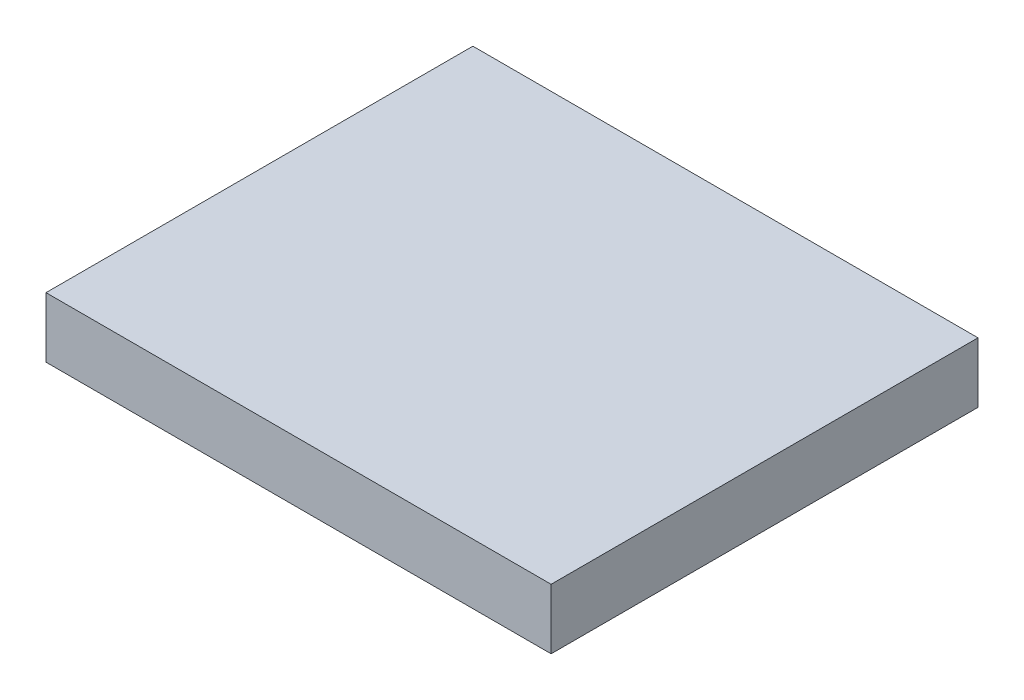
ISO-10303-21;
HEADER;
FILE_DESCRIPTION(('STEP AP214'),'2;1');
FILE_NAME('part.step','',(''),(''),'','','');
FILE_SCHEMA(('AUTOMOTIVE_DESIGN { 1 0 10303 214 1 1 1 1 }'));
ENDSEC;
DATA;
#1=APPLICATION_CONTEXT('core data for automotive mechanical design processes');
#2=APPLICATION_PROTOCOL_DEFINITION('international standard','automotive_design',2000,#1);
#3=PRODUCT_CONTEXT('',#1,'mechanical');
#4=PRODUCT('Part','Part','',(#3));
#5=PRODUCT_RELATED_PRODUCT_CATEGORY('part','',(#4));
#6=PRODUCT_DEFINITION_FORMATION('','',#4);
#7=PRODUCT_DEFINITION_CONTEXT('part definition',#1,'design');
#8=PRODUCT_DEFINITION('design','',#6,#7);
#9=PRODUCT_DEFINITION_SHAPE('','',#8);
#10=(LENGTH_UNIT() NAMED_UNIT(*) SI_UNIT(.MILLI.,.METRE.));
#11=(NAMED_UNIT(*) PLANE_ANGLE_UNIT() SI_UNIT($,.RADIAN.));
#12=(NAMED_UNIT(*) SI_UNIT($,.STERADIAN.) SOLID_ANGLE_UNIT());
#13=UNCERTAINTY_MEASURE_WITH_UNIT(LENGTH_MEASURE(1.E-05),#10,'distance_accuracy_value','');
#14=(GEOMETRIC_REPRESENTATION_CONTEXT(3) GLOBAL_UNCERTAINTY_ASSIGNED_CONTEXT((#13)) GLOBAL_UNIT_ASSIGNED_CONTEXT((#10,
#11,#12)) REPRESENTATION_CONTEXT('',''));
#15=CARTESIAN_POINT('',(0.,0.,0.));
#16=DIRECTION('',(0.,0.,1.));
#17=DIRECTION('',(1.,0.,0.));
#18=AXIS2_PLACEMENT_3D('',#15,#16,#17);
#19=CARTESIAN_POINT('',(-598.949111765251,163.403452751798,587.147449949588));
#20=DIRECTION('',(0.,0.,1.));
#21=DIRECTION('',(1.,0.,0.));
#22=AXIS2_PLACEMENT_3D('',#19,#20,#21);
#23=PLANE('',#22);
#24=DIRECTION('',(1.,0.,0.));
#25=VECTOR('',#24,1.);
#26=CARTESIAN_POINT('',(-598.949111765251,163.403452751798,587.147449949588));
#27=LINE('',#26,#25);
#28=CARTESIAN_POINT('',(-598.949111765251,163.403452751798,587.147449949588));
#29=VERTEX_POINT('',#28);
#30=CARTESIAN_POINT('',(769.050888234749,163.403452751798,587.147449949588));
#31=VERTEX_POINT('',#30);
#32=EDGE_CURVE('E35',#29,#31,#27,.T.);
#33=ORIENTED_EDGE('',*,*,#32,.T.);
#34=DIRECTION('',(0.,-1.,0.));
#35=VECTOR('',#34,1.);
#36=CARTESIAN_POINT('',(769.050888234749,163.403452751798,587.147449949588));
#37=LINE('',#36,#35);
#38=CARTESIAN_POINT('',(769.050888234749,326.525296826174,587.147449949588));
#39=VERTEX_POINT('',#38);
#40=EDGE_CURVE('E72',#39,#31,#37,.T.);
#41=ORIENTED_EDGE('',*,*,#40,.F.);
#42=DIRECTION('',(1.,0.,0.));
#43=VECTOR('',#42,1.);
#44=CARTESIAN_POINT('',(-598.949111765251,326.525296826174,587.147449949588));
#45=LINE('',#44,#43);
#46=CARTESIAN_POINT('',(-598.949111765251,326.525296826174,587.147449949588));
#47=VERTEX_POINT('',#46);
#48=EDGE_CURVE('E11',#47,#39,#45,.T.);
#49=ORIENTED_EDGE('',*,*,#48,.F.);
#50=DIRECTION('',(0.,-1.,0.));
#51=VECTOR('',#50,1.);
#52=CARTESIAN_POINT('',(-598.949111765251,163.403452751798,587.147449949588));
#53=LINE('',#52,#51);
#54=EDGE_CURVE('E73',#47,#29,#53,.T.);
#55=ORIENTED_EDGE('',*,*,#54,.T.);
#56=EDGE_LOOP('',(#33,#41,#49,#55));
#57=FACE_BOUND('',#56,.T.);
#58=ADVANCED_FACE('F32',(#57),#23,.T.);
#59=CARTESIAN_POINT('',(-598.949111765251,326.525296826174,587.147449949588));
#60=DIRECTION('',(0.,1.,0.));
#61=DIRECTION('',(0.,0.,1.));
#62=AXIS2_PLACEMENT_3D('',#59,#60,#61);
#63=PLANE('',#62);
#64=ORIENTED_EDGE('',*,*,#48,.T.);
#65=DIRECTION('',(0.,0.,1.));
#66=VECTOR('',#65,1.);
#67=CARTESIAN_POINT('',(769.050888234749,326.525296826174,587.147449949588));
#68=LINE('',#67,#66);
#69=CARTESIAN_POINT('',(769.050888234749,326.525296826174,-568.978619927519));
#70=VERTEX_POINT('',#69);
#71=EDGE_CURVE('E89',#70,#39,#68,.T.);
#72=ORIENTED_EDGE('',*,*,#71,.F.);
#73=DIRECTION('',(1.,0.,0.));
#74=VECTOR('',#73,1.);
#75=CARTESIAN_POINT('',(-598.949111765251,326.525296826174,-568.978619927519));
#76=LINE('',#75,#74);
#77=CARTESIAN_POINT('',(-598.949111765251,326.525296826174,-568.978619927519));
#78=VERTEX_POINT('',#77);
#79=EDGE_CURVE('E40',#78,#70,#76,.T.);
#80=ORIENTED_EDGE('',*,*,#79,.F.);
#81=DIRECTION('',(0.,0.,1.));
#82=VECTOR('',#81,1.);
#83=CARTESIAN_POINT('',(-598.949111765251,326.525296826174,587.147449949588));
#84=LINE('',#83,#82);
#85=EDGE_CURVE('E78',#78,#47,#84,.T.);
#86=ORIENTED_EDGE('',*,*,#85,.T.);
#87=EDGE_LOOP('',(#64,#72,#80,#86));
#88=FACE_BOUND('',#87,.T.);
#89=ADVANCED_FACE('F104',(#88),#63,.T.);
#90=CARTESIAN_POINT('',(-598.949111765251,163.403452751798,-568.978619927519));
#91=DIRECTION('',(0.,0.,-1.));
#92=DIRECTION('',(-1.,0.,0.));
#93=AXIS2_PLACEMENT_3D('',#90,#91,#92);
#94=PLANE('',#93);
#95=ORIENTED_EDGE('',*,*,#79,.T.);
#96=DIRECTION('',(0.,1.,0.));
#97=VECTOR('',#96,1.);
#98=CARTESIAN_POINT('',(769.050888234749,163.403452751798,-568.978619927519));
#99=LINE('',#98,#97);
#100=CARTESIAN_POINT('',(769.050888234749,163.403452751798,-568.978619927519));
#101=VERTEX_POINT('',#100);
#102=EDGE_CURVE('E85',#101,#70,#99,.T.);
#103=ORIENTED_EDGE('',*,*,#102,.F.);
#104=DIRECTION('',(1.,0.,0.));
#105=VECTOR('',#104,1.);
#106=CARTESIAN_POINT('',(-598.949111765251,163.403452751798,-568.978619927519));
#107=LINE('',#106,#105);
#108=CARTESIAN_POINT('',(-598.949111765251,163.403452751798,-568.978619927519));
#109=VERTEX_POINT('',#108);
#110=EDGE_CURVE('E77',#109,#101,#107,.T.);
#111=ORIENTED_EDGE('',*,*,#110,.F.);
#112=DIRECTION('',(0.,1.,0.));
#113=VECTOR('',#112,1.);
#114=CARTESIAN_POINT('',(-598.949111765251,163.403452751798,-568.978619927519));
#115=LINE('',#114,#113);
#116=EDGE_CURVE('E97',#109,#78,#115,.T.);
#117=ORIENTED_EDGE('',*,*,#116,.T.);
#118=EDGE_LOOP('',(#95,#103,#111,#117));
#119=FACE_BOUND('',#118,.T.);
#120=ADVANCED_FACE('F101',(#119),#94,.T.);
#121=CARTESIAN_POINT('',(-598.949111765251,163.403452751798,587.147449949588));
#122=DIRECTION('',(0.,-1.,0.));
#123=DIRECTION('',(0.,0.,-1.));
#124=AXIS2_PLACEMENT_3D('',#121,#122,#123);
#125=PLANE('',#124);
#126=ORIENTED_EDGE('',*,*,#110,.T.);
#127=DIRECTION('',(0.,0.,-1.));
#128=VECTOR('',#127,1.);
#129=CARTESIAN_POINT('',(769.050888234749,163.403452751798,587.147449949588));
#130=LINE('',#129,#128);
#131=EDGE_CURVE('E80',#31,#101,#130,.T.);
#132=ORIENTED_EDGE('',*,*,#131,.F.);
#133=ORIENTED_EDGE('',*,*,#32,.F.);
#134=DIRECTION('',(0.,0.,-1.));
#135=VECTOR('',#134,1.);
#136=CARTESIAN_POINT('',(-598.949111765251,163.403452751798,587.147449949588));
#137=LINE('',#136,#135);
#138=EDGE_CURVE('E95',#29,#109,#137,.T.);
#139=ORIENTED_EDGE('',*,*,#138,.T.);
#140=EDGE_LOOP('',(#126,#132,#133,#139));
#141=FACE_BOUND('',#140,.T.);
#142=ADVANCED_FACE('F81',(#141),#125,.T.);
#143=CARTESIAN_POINT('',(-598.949111765251,0.,0.));
#144=DIRECTION('',(-1.,0.,0.));
#145=DIRECTION('',(0.,0.,1.));
#146=AXIS2_PLACEMENT_3D('',#143,#144,#145);
#147=PLANE('',#146);
#148=ORIENTED_EDGE('',*,*,#54,.F.);
#149=ORIENTED_EDGE('',*,*,#85,.F.);
#150=ORIENTED_EDGE('',*,*,#116,.F.);
#151=ORIENTED_EDGE('',*,*,#138,.F.);
#152=EDGE_LOOP('',(#148,#149,#150,#151));
#153=FACE_BOUND('',#152,.T.);
#154=ADVANCED_FACE('F106',(#153),#147,.T.);
#155=CARTESIAN_POINT('',(769.050888234749,0.,0.));
#156=DIRECTION('',(-1.,0.,0.));
#157=DIRECTION('',(0.,0.,1.));
#158=AXIS2_PLACEMENT_3D('',#155,#156,#157);
#159=PLANE('',#158);
#160=ORIENTED_EDGE('',*,*,#40,.T.);
#161=ORIENTED_EDGE('',*,*,#131,.T.);
#162=ORIENTED_EDGE('',*,*,#102,.T.);
#163=ORIENTED_EDGE('',*,*,#71,.T.);
#164=EDGE_LOOP('',(#160,#161,#162,#163));
#165=FACE_BOUND('',#164,.T.);
#166=ADVANCED_FACE('F88',(#165),#159,.F.);
#167=CLOSED_SHELL('',(#58,#89,#120,#142,#154,#166));
#168=MANIFOLD_SOLID_BREP('B2',#167);
#169=ADVANCED_BREP_SHAPE_REPRESENTATION('',(#18,#168),#14);
#170=SHAPE_DEFINITION_REPRESENTATION(#9,#169);
ENDSEC;
END-ISO-10303-21;
